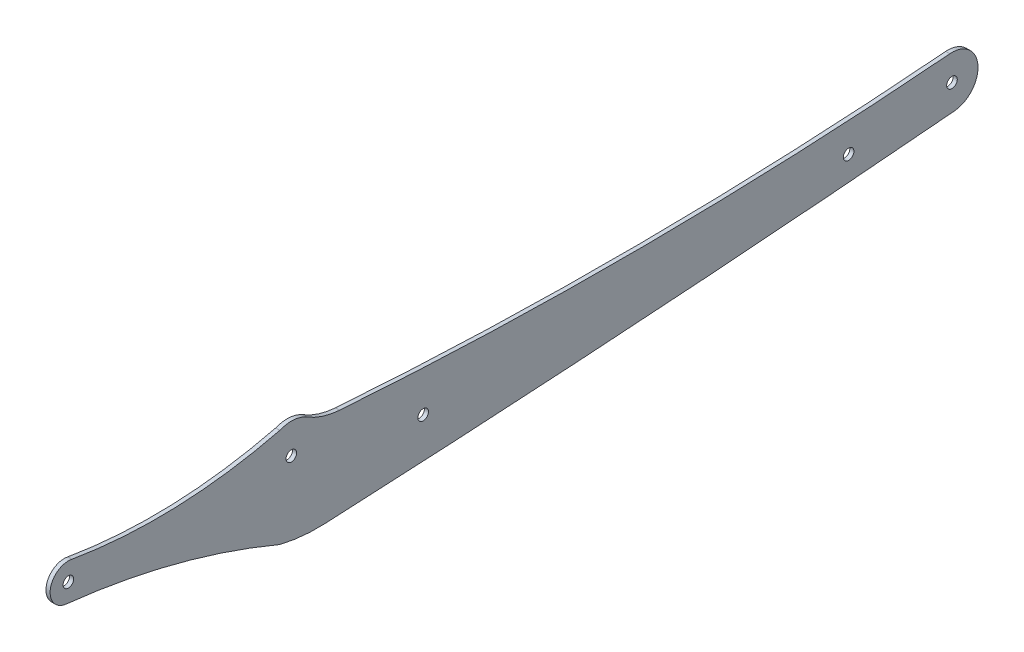
ISO-10303-21;
HEADER;
FILE_DESCRIPTION(('STEP AP214'),'2;1');
FILE_NAME('part.step','',(''),(''),'','','');
FILE_SCHEMA(('AUTOMOTIVE_DESIGN { 1 0 10303 214 1 1 1 1 }'));
ENDSEC;
DATA;
#1=APPLICATION_CONTEXT('core data for automotive mechanical design processes');
#2=APPLICATION_PROTOCOL_DEFINITION('international standard','automotive_design',2000,#1);
#3=PRODUCT_CONTEXT('',#1,'mechanical');
#4=PRODUCT('Part','Part','',(#3));
#5=PRODUCT_RELATED_PRODUCT_CATEGORY('part','',(#4));
#6=PRODUCT_DEFINITION_FORMATION('','',#4);
#7=PRODUCT_DEFINITION_CONTEXT('part definition',#1,'design');
#8=PRODUCT_DEFINITION('design','',#6,#7);
#9=PRODUCT_DEFINITION_SHAPE('','',#8);
#10=(LENGTH_UNIT() NAMED_UNIT(*) SI_UNIT(.MILLI.,.METRE.));
#11=(NAMED_UNIT(*) PLANE_ANGLE_UNIT() SI_UNIT($,.RADIAN.));
#12=(NAMED_UNIT(*) SI_UNIT($,.STERADIAN.) SOLID_ANGLE_UNIT());
#13=UNCERTAINTY_MEASURE_WITH_UNIT(LENGTH_MEASURE(1.E-05),#10,'distance_accuracy_value','');
#14=(GEOMETRIC_REPRESENTATION_CONTEXT(3) GLOBAL_UNCERTAINTY_ASSIGNED_CONTEXT((#13)) GLOBAL_UNIT_ASSIGNED_CONTEXT((#10,
#11,#12)) REPRESENTATION_CONTEXT('',''));
#15=CARTESIAN_POINT('',(0.,0.,0.));
#16=DIRECTION('',(0.,0.,1.));
#17=DIRECTION('',(1.,0.,0.));
#18=AXIS2_PLACEMENT_3D('',#15,#16,#17);
#19=CARTESIAN_POINT('',(1.5,-11.1270790344843,177.528146765181));
#20=DIRECTION('',(-1.,0.,0.));
#21=DIRECTION('',(0.,0.,1.));
#22=AXIS2_PLACEMENT_3D('',#19,#20,#21);
#23=PLANE('',#22);
#24=CARTESIAN_POINT('',(1.5,143.923998945557,117.112791138546));
#25=DIRECTION('',(1.,0.,0.));
#26=DIRECTION('',(0.,0.,1.));
#27=AXIS2_PLACEMENT_3D('',#24,#25,#26);
#28=CIRCLE('',#27,57.9949166369747);
#29=CARTESIAN_POINT('',(1.5,87.5910719085076,130.897263822267));
#30=VERTEX_POINT('',#29);
#31=CARTESIAN_POINT('',(1.5,85.9930680060206,114.389264709782));
#32=VERTEX_POINT('',#31);
#33=EDGE_CURVE('E152',#30,#32,#28,.T.);
#34=ORIENTED_EDGE('',*,*,#33,.T.);
#35=CARTESIAN_POINT('',(1.5,5643.34758799658,375.659050366511));
#36=DIRECTION('',(1.,0.,0.));
#37=DIRECTION('',(0.,0.,-1.));
#38=AXIS2_PLACEMENT_3D('',#35,#36,#37);
#39=CIRCLE('',#38,5563.49271247448);
#40=CARTESIAN_POINT('',(1.5,101.479740068085,-114.393924170945));
#41=VERTEX_POINT('',#40);
#42=EDGE_CURVE('E95',#32,#41,#39,.T.);
#43=ORIENTED_EDGE('',*,*,#42,.T.);
#44=CARTESIAN_POINT('',(1.5,110.873964993523,-113.258391089149));
#45=DIRECTION('',(1.,0.,0.));
#46=DIRECTION('',(0.,0.,-1.));
#47=AXIS2_PLACEMENT_3D('',#44,#45,#46);
#48=CIRCLE('',#47,9.46260520837563);
#49=CARTESIAN_POINT('',(1.5,120.303616590444,-112.469361247952));
#50=VERTEX_POINT('',#49);
#51=EDGE_CURVE('E170',#41,#50,#48,.T.);
#52=ORIENTED_EDGE('',*,*,#51,.T.);
#53=CARTESIAN_POINT('',(1.5,1544.36437526444,6.68948784495678));
#54=DIRECTION('',(-1.,0.,0.));
#55=DIRECTION('',(0.,0.,-1.));
#56=AXIS2_PLACEMENT_3D('',#53,#54,#55);
#57=CIRCLE('',#56,1429.03739479144);
#58=CARTESIAN_POINT('',(1.5,119.009812321446,109.218730551069));
#59=VERTEX_POINT('',#58);
#60=EDGE_CURVE('E187',#50,#59,#57,.T.);
#61=ORIENTED_EDGE('',*,*,#60,.T.);
#62=CARTESIAN_POINT('',(1.5,145.478816486396,107.314750290501));
#63=DIRECTION('',(-1.,0.,0.));
#64=DIRECTION('',(0.,0.,-1.));
#65=AXIS2_PLACEMENT_3D('',#62,#63,#64);
#66=CIRCLE('',#65,26.5373947914402);
#67=CARTESIAN_POINT('',(1.5,122.77436665141,121.053064597847));
#68=VERTEX_POINT('',#67);
#69=EDGE_CURVE('E186',#59,#68,#66,.T.);
#70=ORIENTED_EDGE('',*,*,#69,.T.);
#71=CARTESIAN_POINT('',(1.5,113.395152076107,126.728366079631));
#72=DIRECTION('',(1.,0.,0.));
#73=DIRECTION('',(0.,0.,-1.));
#74=AXIS2_PLACEMENT_3D('',#71,#72,#73);
#75=CIRCLE('',#74,10.9626052085589);
#76=CARTESIAN_POINT('',(1.5,123.534136471506,130.897263822267));
#77=VERTEX_POINT('',#76);
#78=EDGE_CURVE('E117',#68,#77,#75,.T.);
#79=ORIENTED_EDGE('',*,*,#78,.T.);
#80=CARTESIAN_POINT('',(1.5,302.350623143857,175.320580449456));
#81=DIRECTION('',(-1.,0.,0.));
#82=DIRECTION('',(0.,0.,-1.));
#83=AXIS2_PLACEMENT_3D('',#80,#81,#82);
#84=CIRCLE('',#83,184.251911702437);
#85=CARTESIAN_POINT('',(1.5,120.739850680516,206.405854957994));
#86=VERTEX_POINT('',#85);
#87=EDGE_CURVE('E111',#77,#86,#84,.T.);
#88=ORIENTED_EDGE('',*,*,#87,.T.);
#89=CARTESIAN_POINT('',(1.5,114.246052716474,207.723896623604));
#90=DIRECTION('',(1.,0.,0.));
#91=DIRECTION('',(0.,0.,-1.));
#92=AXIS2_PLACEMENT_3D('',#89,#90,#91);
#93=CIRCLE('',#92,6.62620900893442);
#94=CARTESIAN_POINT('',(1.5,107.645763729695,208.309414446639));
#95=VERTEX_POINT('',#94);
#96=EDGE_CURVE('E115',#86,#95,#93,.T.);
#97=ORIENTED_EDGE('',*,*,#96,.T.);
#98=CARTESIAN_POINT('',(1.5,-166.178157014526,237.943502391815));
#99=DIRECTION('',(-1.,0.,0.));
#100=DIRECTION('',(0.,0.,-1.));
#101=AXIS2_PLACEMENT_3D('',#98,#99,#100);
#102=CIRCLE('',#101,275.422799964127);
#103=EDGE_CURVE('E49',#95,#30,#102,.T.);
#104=ORIENTED_EDGE('',*,*,#103,.T.);
#105=EDGE_LOOP('',(#34,#43,#52,#61,#70,#79,#88,#97,#104));
#106=FACE_BOUND('',#105,.T.);
#107=CARTESIAN_POINT('',(1.5,110.873964993523,-113.258391089149));
#108=DIRECTION('',(1.,0.,0.));
#109=DIRECTION('',(0.,0.,-1.));
#110=AXIS2_PLACEMENT_3D('',#107,#108,#109);
#111=CIRCLE('',#110,1.9249999998562);
#112=CARTESIAN_POINT('',(1.5,110.873964993523,-115.183391089005));
#113=VERTEX_POINT('',#112);
#114=EDGE_CURVE('E139',#113,#113,#111,.T.);
#115=ORIENTED_EDGE('',*,*,#114,.F.);
#116=EDGE_LOOP('',(#115));
#117=FACE_BOUND('',#116,.T.);
#118=CARTESIAN_POINT('',(1.5,114.246052716474,207.723896623604));
#119=DIRECTION('',(1.,0.,0.));
#120=DIRECTION('',(0.,0.,-1.));
#121=AXIS2_PLACEMENT_3D('',#118,#119,#120);
#122=CIRCLE('',#121,1.92499999998844);
#123=CARTESIAN_POINT('',(1.5,114.246052716474,205.798896623616));
#124=VERTEX_POINT('',#123);
#125=EDGE_CURVE('E197',#124,#124,#122,.T.);
#126=ORIENTED_EDGE('',*,*,#125,.F.);
#127=EDGE_LOOP('',(#126));
#128=FACE_BOUND('',#127,.T.);
#129=CARTESIAN_POINT('',(1.5,102.391494033522,78.8413165810308));
#130=DIRECTION('',(1.,0.,0.));
#131=DIRECTION('',(0.,0.,-1.));
#132=AXIS2_PLACEMENT_3D('',#129,#130,#131);
#133=CIRCLE('',#132,1.9249999999999);
#134=CARTESIAN_POINT('',(1.5,102.391494033522,76.9163165810309));
#135=VERTEX_POINT('',#134);
#136=EDGE_CURVE('E203',#135,#135,#133,.T.);
#137=ORIENTED_EDGE('',*,*,#136,.F.);
#138=EDGE_LOOP('',(#137));
#139=FACE_BOUND('',#138,.T.);
#140=CARTESIAN_POINT('',(1.5,113.395152076107,126.728366079631));
#141=DIRECTION('',(1.,0.,0.));
#142=DIRECTION('',(0.,0.,-1.));
#143=AXIS2_PLACEMENT_3D('',#140,#141,#142);
#144=CIRCLE('',#143,1.925);
#145=CARTESIAN_POINT('',(1.5,113.395152076107,124.803366079631));
#146=VERTEX_POINT('',#145);
#147=EDGE_CURVE('E209',#146,#146,#144,.T.);
#148=ORIENTED_EDGE('',*,*,#147,.F.);
#149=EDGE_LOOP('',(#148));
#150=FACE_BOUND('',#149,.T.);
#151=CARTESIAN_POINT('',(1.5,107.068132224757,-75.7163395063619));
#152=DIRECTION('',(1.,0.,0.));
#153=DIRECTION('',(0.,0.,-1.));
#154=AXIS2_PLACEMENT_3D('',#151,#152,#153);
#155=CIRCLE('',#154,1.92499999999994);
#156=CARTESIAN_POINT('',(1.5,107.068132224757,-77.6413395063619));
#157=VERTEX_POINT('',#156);
#158=EDGE_CURVE('E215',#157,#157,#155,.T.);
#159=ORIENTED_EDGE('',*,*,#158,.F.);
#160=EDGE_LOOP('',(#159));
#161=FACE_BOUND('',#160,.T.);
#162=ADVANCED_FACE('F32',(#106,#117,#128,#139,#150,#161),#23,.F.);
#163=CARTESIAN_POINT('',(0.,-11.1270790344843,177.528146765181));
#164=DIRECTION('',(-1.,0.,0.));
#165=DIRECTION('',(0.,0.,1.));
#166=AXIS2_PLACEMENT_3D('',#163,#164,#165);
#167=PLANE('',#166);
#168=CARTESIAN_POINT('',(0.,113.395152076107,126.728366079631));
#169=DIRECTION('',(1.,0.,0.));
#170=DIRECTION('',(0.,0.,-1.));
#171=AXIS2_PLACEMENT_3D('',#168,#169,#170);
#172=CIRCLE('',#171,1.925);
#173=CARTESIAN_POINT('',(0.,113.395152076107,124.803366079631));
#174=VERTEX_POINT('',#173);
#175=EDGE_CURVE('E212',#174,#174,#172,.T.);
#176=ORIENTED_EDGE('',*,*,#175,.T.);
#177=EDGE_LOOP('',(#176));
#178=FACE_BOUND('',#177,.T.);
#179=CARTESIAN_POINT('',(0.,114.246052716474,207.723896623604));
#180=DIRECTION('',(1.,0.,0.));
#181=DIRECTION('',(0.,0.,-1.));
#182=AXIS2_PLACEMENT_3D('',#179,#180,#181);
#183=CIRCLE('',#182,1.92499999998844);
#184=CARTESIAN_POINT('',(0.,114.246052716474,205.798896623616));
#185=VERTEX_POINT('',#184);
#186=EDGE_CURVE('E200',#185,#185,#183,.T.);
#187=ORIENTED_EDGE('',*,*,#186,.T.);
#188=EDGE_LOOP('',(#187));
#189=FACE_BOUND('',#188,.T.);
#190=CARTESIAN_POINT('',(0.,143.923998945557,117.112791138546));
#191=DIRECTION('',(1.,0.,0.));
#192=DIRECTION('',(0.,0.,1.));
#193=AXIS2_PLACEMENT_3D('',#190,#191,#192);
#194=CIRCLE('',#193,57.9949166369747);
#195=CARTESIAN_POINT('',(0.,87.5910719085076,130.897263822267));
#196=VERTEX_POINT('',#195);
#197=CARTESIAN_POINT('',(0.,85.9930680060206,114.389264709782));
#198=VERTEX_POINT('',#197);
#199=EDGE_CURVE('E135',#196,#198,#194,.T.);
#200=ORIENTED_EDGE('',*,*,#199,.F.);
#201=CARTESIAN_POINT('',(0.,-166.178157014526,237.943502391815));
#202=DIRECTION('',(-1.,0.,0.));
#203=DIRECTION('',(0.,0.,-1.));
#204=AXIS2_PLACEMENT_3D('',#201,#202,#203);
#205=CIRCLE('',#204,275.422799964127);
#206=CARTESIAN_POINT('',(0.,107.645763729695,208.309414446639));
#207=VERTEX_POINT('',#206);
#208=EDGE_CURVE('E87',#207,#196,#205,.T.);
#209=ORIENTED_EDGE('',*,*,#208,.F.);
#210=CARTESIAN_POINT('',(0.,114.246052716474,207.723896623604));
#211=DIRECTION('',(1.,0.,0.));
#212=DIRECTION('',(0.,0.,-1.));
#213=AXIS2_PLACEMENT_3D('',#210,#211,#212);
#214=CIRCLE('',#213,6.62620900893442);
#215=CARTESIAN_POINT('',(0.,120.739850680516,206.405854957994));
#216=VERTEX_POINT('',#215);
#217=EDGE_CURVE('E81',#216,#207,#214,.T.);
#218=ORIENTED_EDGE('',*,*,#217,.F.);
#219=CARTESIAN_POINT('',(0.,302.350623143857,175.320580449456));
#220=DIRECTION('',(-1.,0.,0.));
#221=DIRECTION('',(0.,0.,-1.));
#222=AXIS2_PLACEMENT_3D('',#219,#220,#221);
#223=CIRCLE('',#222,184.251911702437);
#224=CARTESIAN_POINT('',(0.,123.534136471506,130.897263822267));
#225=VERTEX_POINT('',#224);
#226=EDGE_CURVE('E125',#225,#216,#223,.T.);
#227=ORIENTED_EDGE('',*,*,#226,.F.);
#228=CARTESIAN_POINT('',(0.,113.395152076107,126.728366079631));
#229=DIRECTION('',(1.,0.,0.));
#230=DIRECTION('',(0.,0.,-1.));
#231=AXIS2_PLACEMENT_3D('',#228,#229,#230);
#232=CIRCLE('',#231,10.9626052085589);
#233=CARTESIAN_POINT('',(0.,122.77436665141,121.053064597847));
#234=VERTEX_POINT('',#233);
#235=EDGE_CURVE('E147',#234,#225,#232,.T.);
#236=ORIENTED_EDGE('',*,*,#235,.F.);
#237=CARTESIAN_POINT('',(0.,145.478816486396,107.314750290501));
#238=DIRECTION('',(-1.,0.,0.));
#239=DIRECTION('',(0.,0.,-1.));
#240=AXIS2_PLACEMENT_3D('',#237,#238,#239);
#241=CIRCLE('',#240,26.5373947914402);
#242=CARTESIAN_POINT('',(0.,119.009812321446,109.218730551069));
#243=VERTEX_POINT('',#242);
#244=EDGE_CURVE('E145',#243,#234,#241,.T.);
#245=ORIENTED_EDGE('',*,*,#244,.F.);
#246=CARTESIAN_POINT('',(0.,1544.36437526444,6.68948784495678));
#247=DIRECTION('',(-1.,0.,0.));
#248=DIRECTION('',(0.,0.,-1.));
#249=AXIS2_PLACEMENT_3D('',#246,#247,#248);
#250=CIRCLE('',#249,1429.03739479144);
#251=CARTESIAN_POINT('',(0.,120.303616590444,-112.469361247952));
#252=VERTEX_POINT('',#251);
#253=EDGE_CURVE('E143',#252,#243,#250,.T.);
#254=ORIENTED_EDGE('',*,*,#253,.F.);
#255=CARTESIAN_POINT('',(0.,110.873964993523,-113.258391089149));
#256=DIRECTION('',(1.,0.,0.));
#257=DIRECTION('',(0.,0.,-1.));
#258=AXIS2_PLACEMENT_3D('',#255,#256,#257);
#259=CIRCLE('',#258,9.46260520837563);
#260=CARTESIAN_POINT('',(0.,101.479740068085,-114.393924170945));
#261=VERTEX_POINT('',#260);
#262=EDGE_CURVE('E141',#261,#252,#259,.T.);
#263=ORIENTED_EDGE('',*,*,#262,.F.);
#264=CARTESIAN_POINT('',(0.,5643.34758799658,375.659050366511));
#265=DIRECTION('',(1.,0.,0.));
#266=DIRECTION('',(0.,0.,-1.));
#267=AXIS2_PLACEMENT_3D('',#264,#265,#266);
#268=CIRCLE('',#267,5563.49271247448);
#269=EDGE_CURVE('E138',#198,#261,#268,.T.);
#270=ORIENTED_EDGE('',*,*,#269,.F.);
#271=EDGE_LOOP('',(#200,#209,#218,#227,#236,#245,#254,#263,#270));
#272=FACE_BOUND('',#271,.T.);
#273=CARTESIAN_POINT('',(0.,110.873964993523,-113.258391089149));
#274=DIRECTION('',(1.,0.,0.));
#275=DIRECTION('',(0.,0.,-1.));
#276=AXIS2_PLACEMENT_3D('',#273,#274,#275);
#277=CIRCLE('',#276,1.9249999998562);
#278=CARTESIAN_POINT('',(0.,110.873964993523,-115.183391089005));
#279=VERTEX_POINT('',#278);
#280=EDGE_CURVE('E194',#279,#279,#277,.T.);
#281=ORIENTED_EDGE('',*,*,#280,.T.);
#282=EDGE_LOOP('',(#281));
#283=FACE_BOUND('',#282,.T.);
#284=CARTESIAN_POINT('',(0.,102.391494033522,78.8413165810308));
#285=DIRECTION('',(1.,0.,0.));
#286=DIRECTION('',(0.,0.,-1.));
#287=AXIS2_PLACEMENT_3D('',#284,#285,#286);
#288=CIRCLE('',#287,1.9249999999999);
#289=CARTESIAN_POINT('',(0.,102.391494033522,76.9163165810309));
#290=VERTEX_POINT('',#289);
#291=EDGE_CURVE('E206',#290,#290,#288,.T.);
#292=ORIENTED_EDGE('',*,*,#291,.T.);
#293=EDGE_LOOP('',(#292));
#294=FACE_BOUND('',#293,.T.);
#295=CARTESIAN_POINT('',(0.,107.068132224757,-75.7163395063619));
#296=DIRECTION('',(1.,0.,0.));
#297=DIRECTION('',(0.,0.,-1.));
#298=AXIS2_PLACEMENT_3D('',#295,#296,#297);
#299=CIRCLE('',#298,1.92499999999994);
#300=CARTESIAN_POINT('',(0.,107.068132224757,-77.6413395063619));
#301=VERTEX_POINT('',#300);
#302=EDGE_CURVE('E218',#301,#301,#299,.T.);
#303=ORIENTED_EDGE('',*,*,#302,.T.);
#304=EDGE_LOOP('',(#303));
#305=FACE_BOUND('',#304,.T.);
#306=ADVANCED_FACE('F174',(#178,#189,#272,#283,#294,#305),#167,.T.);
#307=CARTESIAN_POINT('',(1.5,143.923998945557,117.112791138546));
#308=DIRECTION('',(-1.,0.,0.));
#309=DIRECTION('',(0.,0.,1.));
#310=AXIS2_PLACEMENT_3D('',#307,#308,#309);
#311=CYLINDRICAL_SURFACE('',#310,57.9949166369747);
#312=ORIENTED_EDGE('',*,*,#199,.T.);
#313=DIRECTION('',(-1.,0.,0.));
#314=VECTOR('',#313,1.);
#315=CARTESIAN_POINT('',(1.5,85.9930680060206,114.389264709782));
#316=LINE('',#315,#314);
#317=EDGE_CURVE('E11',#32,#198,#316,.T.);
#318=ORIENTED_EDGE('',*,*,#317,.F.);
#319=ORIENTED_EDGE('',*,*,#33,.F.);
#320=DIRECTION('',(-1.,0.,0.));
#321=VECTOR('',#320,1.);
#322=CARTESIAN_POINT('',(1.5,87.5910719085076,130.897263822267));
#323=LINE('',#322,#321);
#324=EDGE_CURVE('E131',#30,#196,#323,.T.);
#325=ORIENTED_EDGE('',*,*,#324,.T.);
#326=EDGE_LOOP('',(#312,#318,#319,#325));
#327=FACE_BOUND('',#326,.T.);
#328=ADVANCED_FACE('F34',(#327),#311,.T.);
#329=CARTESIAN_POINT('',(1.5,5643.34758799658,375.659050366511));
#330=DIRECTION('',(-1.,0.,0.));
#331=DIRECTION('',(0.,0.,1.));
#332=AXIS2_PLACEMENT_3D('',#329,#330,#331);
#333=CYLINDRICAL_SURFACE('',#332,5563.49271247448);
#334=ORIENTED_EDGE('',*,*,#269,.T.);
#335=DIRECTION('',(-1.,0.,0.));
#336=VECTOR('',#335,1.);
#337=CARTESIAN_POINT('',(1.5,101.479740068085,-114.393924170945));
#338=LINE('',#337,#336);
#339=EDGE_CURVE('E41',#41,#261,#338,.T.);
#340=ORIENTED_EDGE('',*,*,#339,.F.);
#341=ORIENTED_EDGE('',*,*,#42,.F.);
#342=ORIENTED_EDGE('',*,*,#317,.T.);
#343=EDGE_LOOP('',(#334,#340,#341,#342));
#344=FACE_BOUND('',#343,.T.);
#345=ADVANCED_FACE('F254',(#344),#333,.T.);
#346=CARTESIAN_POINT('',(1.5,110.873964993523,-113.258391089149));
#347=DIRECTION('',(-1.,0.,0.));
#348=DIRECTION('',(0.,0.,1.));
#349=AXIS2_PLACEMENT_3D('',#346,#347,#348);
#350=CYLINDRICAL_SURFACE('',#349,9.46260520837563);
#351=ORIENTED_EDGE('',*,*,#262,.T.);
#352=DIRECTION('',(-1.,0.,0.));
#353=VECTOR('',#352,1.);
#354=CARTESIAN_POINT('',(1.5,120.303616590444,-112.469361247952));
#355=LINE('',#354,#353);
#356=EDGE_CURVE('E162',#50,#252,#355,.T.);
#357=ORIENTED_EDGE('',*,*,#356,.F.);
#358=ORIENTED_EDGE('',*,*,#51,.F.);
#359=ORIENTED_EDGE('',*,*,#339,.T.);
#360=EDGE_LOOP('',(#351,#357,#358,#359));
#361=FACE_BOUND('',#360,.T.);
#362=ADVANCED_FACE('F168',(#361),#350,.T.);
#363=CARTESIAN_POINT('',(1.5,1544.36437526444,6.68948784495678));
#364=DIRECTION('',(-1.,0.,0.));
#365=DIRECTION('',(0.,0.,1.));
#366=AXIS2_PLACEMENT_3D('',#363,#364,#365);
#367=CYLINDRICAL_SURFACE('',#366,1429.03739479144);
#368=ORIENTED_EDGE('',*,*,#253,.T.);
#369=DIRECTION('',(-1.,0.,0.));
#370=VECTOR('',#369,1.);
#371=CARTESIAN_POINT('',(1.5,119.009812321446,109.218730551069));
#372=LINE('',#371,#370);
#373=EDGE_CURVE('E159',#59,#243,#372,.T.);
#374=ORIENTED_EDGE('',*,*,#373,.F.);
#375=ORIENTED_EDGE('',*,*,#60,.F.);
#376=ORIENTED_EDGE('',*,*,#356,.T.);
#377=EDGE_LOOP('',(#368,#374,#375,#376));
#378=FACE_BOUND('',#377,.T.);
#379=ADVANCED_FACE('F180',(#378),#367,.F.);
#380=CARTESIAN_POINT('',(1.5,145.478816486396,107.314750290501));
#381=DIRECTION('',(-1.,0.,0.));
#382=DIRECTION('',(0.,0.,1.));
#383=AXIS2_PLACEMENT_3D('',#380,#381,#382);
#384=CYLINDRICAL_SURFACE('',#383,26.5373947914402);
#385=ORIENTED_EDGE('',*,*,#244,.T.);
#386=DIRECTION('',(-1.,0.,0.));
#387=VECTOR('',#386,1.);
#388=CARTESIAN_POINT('',(1.5,122.77436665141,121.053064597847));
#389=LINE('',#388,#387);
#390=EDGE_CURVE('E156',#68,#234,#389,.T.);
#391=ORIENTED_EDGE('',*,*,#390,.F.);
#392=ORIENTED_EDGE('',*,*,#69,.F.);
#393=ORIENTED_EDGE('',*,*,#373,.T.);
#394=EDGE_LOOP('',(#385,#391,#392,#393));
#395=FACE_BOUND('',#394,.T.);
#396=ADVANCED_FACE('F184',(#395),#384,.F.);
#397=CARTESIAN_POINT('',(1.5,113.395152076107,126.728366079631));
#398=DIRECTION('',(-1.,0.,0.));
#399=DIRECTION('',(0.,0.,1.));
#400=AXIS2_PLACEMENT_3D('',#397,#398,#399);
#401=CYLINDRICAL_SURFACE('',#400,10.9626052085589);
#402=ORIENTED_EDGE('',*,*,#235,.T.);
#403=DIRECTION('',(-1.,0.,0.));
#404=VECTOR('',#403,1.);
#405=CARTESIAN_POINT('',(1.5,123.534136471506,130.897263822267));
#406=LINE('',#405,#404);
#407=EDGE_CURVE('E126',#77,#225,#406,.T.);
#408=ORIENTED_EDGE('',*,*,#407,.F.);
#409=ORIENTED_EDGE('',*,*,#78,.F.);
#410=ORIENTED_EDGE('',*,*,#390,.T.);
#411=EDGE_LOOP('',(#402,#408,#409,#410));
#412=FACE_BOUND('',#411,.T.);
#413=ADVANCED_FACE('F245',(#412),#401,.T.);
#414=CARTESIAN_POINT('',(1.5,302.350623143857,175.320580449456));
#415=DIRECTION('',(-1.,0.,0.));
#416=DIRECTION('',(0.,0.,1.));
#417=AXIS2_PLACEMENT_3D('',#414,#415,#416);
#418=CYLINDRICAL_SURFACE('',#417,184.251911702437);
#419=ORIENTED_EDGE('',*,*,#226,.T.);
#420=DIRECTION('',(-1.,0.,0.));
#421=VECTOR('',#420,1.);
#422=CARTESIAN_POINT('',(1.5,120.739850680516,206.405854957994));
#423=LINE('',#422,#421);
#424=EDGE_CURVE('E122',#86,#216,#423,.T.);
#425=ORIENTED_EDGE('',*,*,#424,.F.);
#426=ORIENTED_EDGE('',*,*,#87,.F.);
#427=ORIENTED_EDGE('',*,*,#407,.T.);
#428=EDGE_LOOP('',(#419,#425,#426,#427));
#429=FACE_BOUND('',#428,.T.);
#430=ADVANCED_FACE('F123',(#429),#418,.F.);
#431=CARTESIAN_POINT('',(1.5,114.246052716474,207.723896623604));
#432=DIRECTION('',(-1.,0.,0.));
#433=DIRECTION('',(0.,0.,1.));
#434=AXIS2_PLACEMENT_3D('',#431,#432,#433);
#435=CYLINDRICAL_SURFACE('',#434,6.62620900893442);
#436=ORIENTED_EDGE('',*,*,#217,.T.);
#437=DIRECTION('',(-1.,0.,0.));
#438=VECTOR('',#437,1.);
#439=CARTESIAN_POINT('',(1.5,107.645763729695,208.309414446639));
#440=LINE('',#439,#438);
#441=EDGE_CURVE('E127',#95,#207,#440,.T.);
#442=ORIENTED_EDGE('',*,*,#441,.F.);
#443=ORIENTED_EDGE('',*,*,#96,.F.);
#444=ORIENTED_EDGE('',*,*,#424,.T.);
#445=EDGE_LOOP('',(#436,#442,#443,#444));
#446=FACE_BOUND('',#445,.T.);
#447=ADVANCED_FACE('F129',(#446),#435,.T.);
#448=CARTESIAN_POINT('',(1.5,-166.178157014526,237.943502391815));
#449=DIRECTION('',(-1.,0.,0.));
#450=DIRECTION('',(0.,0.,1.));
#451=AXIS2_PLACEMENT_3D('',#448,#449,#450);
#452=CYLINDRICAL_SURFACE('',#451,275.422799964127);
#453=ORIENTED_EDGE('',*,*,#208,.T.);
#454=ORIENTED_EDGE('',*,*,#324,.F.);
#455=ORIENTED_EDGE('',*,*,#103,.F.);
#456=ORIENTED_EDGE('',*,*,#441,.T.);
#457=EDGE_LOOP('',(#453,#454,#455,#456));
#458=FACE_BOUND('',#457,.T.);
#459=ADVANCED_FACE('F238',(#458),#452,.F.);
#460=CARTESIAN_POINT('',(1.5,110.873964993523,-113.258391089149));
#461=DIRECTION('',(-1.,0.,0.));
#462=DIRECTION('',(0.,0.,1.));
#463=AXIS2_PLACEMENT_3D('',#460,#461,#462);
#464=CYLINDRICAL_SURFACE('',#463,1.9249999998562);
#465=ORIENTED_EDGE('',*,*,#114,.T.);
#466=EDGE_LOOP('',(#465));
#467=FACE_BOUND('',#466,.T.);
#468=ORIENTED_EDGE('',*,*,#280,.F.);
#469=EDGE_LOOP('',(#468));
#470=FACE_BOUND('',#469,.T.);
#471=ADVANCED_FACE('F235',(#467,#470),#464,.F.);
#472=CARTESIAN_POINT('',(1.5,114.246052716474,207.723896623604));
#473=DIRECTION('',(-1.,0.,0.));
#474=DIRECTION('',(0.,0.,1.));
#475=AXIS2_PLACEMENT_3D('',#472,#473,#474);
#476=CYLINDRICAL_SURFACE('',#475,1.92499999998844);
#477=ORIENTED_EDGE('',*,*,#125,.T.);
#478=EDGE_LOOP('',(#477));
#479=FACE_BOUND('',#478,.T.);
#480=ORIENTED_EDGE('',*,*,#186,.F.);
#481=EDGE_LOOP('',(#480));
#482=FACE_BOUND('',#481,.T.);
#483=ADVANCED_FACE('F323',(#479,#482),#476,.F.);
#484=CARTESIAN_POINT('',(1.5,102.391494033522,78.8413165810308));
#485=DIRECTION('',(-1.,0.,0.));
#486=DIRECTION('',(0.,0.,1.));
#487=AXIS2_PLACEMENT_3D('',#484,#485,#486);
#488=CYLINDRICAL_SURFACE('',#487,1.9249999999999);
#489=ORIENTED_EDGE('',*,*,#136,.T.);
#490=EDGE_LOOP('',(#489));
#491=FACE_BOUND('',#490,.T.);
#492=ORIENTED_EDGE('',*,*,#291,.F.);
#493=EDGE_LOOP('',(#492));
#494=FACE_BOUND('',#493,.T.);
#495=ADVANCED_FACE('F331',(#491,#494),#488,.F.);
#496=CARTESIAN_POINT('',(1.5,113.395152076107,126.728366079631));
#497=DIRECTION('',(-1.,0.,0.));
#498=DIRECTION('',(0.,0.,1.));
#499=AXIS2_PLACEMENT_3D('',#496,#497,#498);
#500=CYLINDRICAL_SURFACE('',#499,1.925);
#501=ORIENTED_EDGE('',*,*,#147,.T.);
#502=EDGE_LOOP('',(#501));
#503=FACE_BOUND('',#502,.T.);
#504=ORIENTED_EDGE('',*,*,#175,.F.);
#505=EDGE_LOOP('',(#504));
#506=FACE_BOUND('',#505,.T.);
#507=ADVANCED_FACE('F339',(#503,#506),#500,.F.);
#508=CARTESIAN_POINT('',(1.5,107.068132224757,-75.7163395063619));
#509=DIRECTION('',(-1.,0.,0.));
#510=DIRECTION('',(0.,0.,1.));
#511=AXIS2_PLACEMENT_3D('',#508,#509,#510);
#512=CYLINDRICAL_SURFACE('',#511,1.92499999999994);
#513=ORIENTED_EDGE('',*,*,#158,.T.);
#514=EDGE_LOOP('',(#513));
#515=FACE_BOUND('',#514,.T.);
#516=ORIENTED_EDGE('',*,*,#302,.F.);
#517=EDGE_LOOP('',(#516));
#518=FACE_BOUND('',#517,.T.);
#519=ADVANCED_FACE('F224',(#515,#518),#512,.F.);
#520=CLOSED_SHELL('',(#162,#306,#328,#345,#362,#379,#396,#413,#430,#447,#459,#471,#483,#495,
#507,#519));
#521=MANIFOLD_SOLID_BREP('B2',#520);
#522=ADVANCED_BREP_SHAPE_REPRESENTATION('',(#18,#521),#14);
#523=SHAPE_DEFINITION_REPRESENTATION(#9,#522);
ENDSEC;
END-ISO-10303-21;
